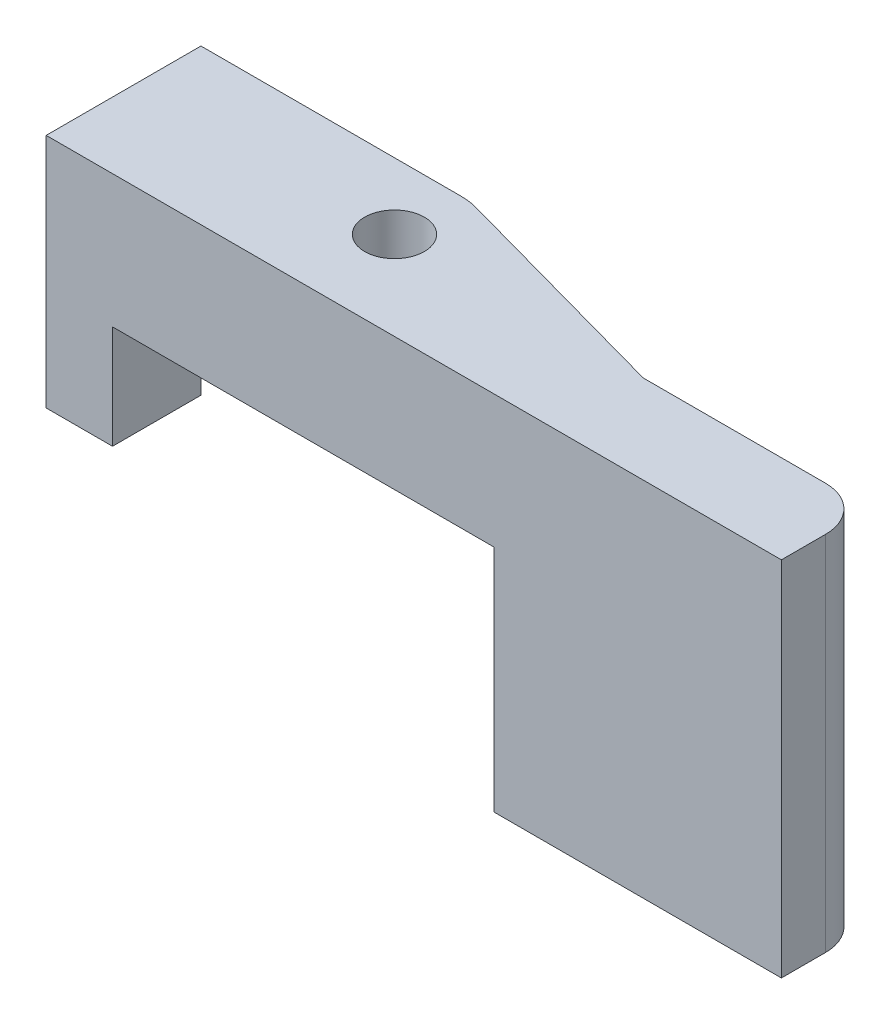
ISO-10303-21;
HEADER;
FILE_DESCRIPTION(('STEP AP214'),'2;1');
FILE_NAME('part.step','',(''),(''),'','','');
FILE_SCHEMA(('AUTOMOTIVE_DESIGN { 1 0 10303 214 1 1 1 1 }'));
ENDSEC;
DATA;
#1=APPLICATION_CONTEXT('core data for automotive mechanical design processes');
#2=APPLICATION_PROTOCOL_DEFINITION('international standard','automotive_design',2000,#1);
#3=PRODUCT_CONTEXT('',#1,'mechanical');
#4=PRODUCT('Part','Part','',(#3));
#5=PRODUCT_RELATED_PRODUCT_CATEGORY('part','',(#4));
#6=PRODUCT_DEFINITION_FORMATION('','',#4);
#7=PRODUCT_DEFINITION_CONTEXT('part definition',#1,'design');
#8=PRODUCT_DEFINITION('design','',#6,#7);
#9=PRODUCT_DEFINITION_SHAPE('','',#8);
#10=(LENGTH_UNIT() NAMED_UNIT(*) SI_UNIT(.MILLI.,.METRE.));
#11=(NAMED_UNIT(*) PLANE_ANGLE_UNIT() SI_UNIT($,.RADIAN.));
#12=(NAMED_UNIT(*) SI_UNIT($,.STERADIAN.) SOLID_ANGLE_UNIT());
#13=UNCERTAINTY_MEASURE_WITH_UNIT(LENGTH_MEASURE(1.E-05),#10,'distance_accuracy_value','');
#14=(GEOMETRIC_REPRESENTATION_CONTEXT(3) GLOBAL_UNCERTAINTY_ASSIGNED_CONTEXT((#13)) GLOBAL_UNIT_ASSIGNED_CONTEXT((#10,
#11,#12)) REPRESENTATION_CONTEXT('',''));
#15=CARTESIAN_POINT('',(0.,0.,0.));
#16=DIRECTION('',(0.,0.,1.));
#17=DIRECTION('',(1.,0.,0.));
#18=AXIS2_PLACEMENT_3D('',#15,#16,#17);
#19=CARTESIAN_POINT('',(0.,0.,0.));
#20=DIRECTION('',(0.,-1.,0.));
#21=DIRECTION('',(0.,0.,1.));
#22=AXIS2_PLACEMENT_3D('',#19,#20,#21);
#23=PLANE('',#22);
#24=DIRECTION('',(-1.,0.,0.));
#25=VECTOR('',#24,1.);
#26=CARTESIAN_POINT('',(0.,0.,0.));
#27=LINE('',#26,#25);
#28=CARTESIAN_POINT('',(-8.75411972844536,0.,0.));
#29=VERTEX_POINT('',#28);
#30=CARTESIAN_POINT('',(-11.7541197284454,0.,0.));
#31=VERTEX_POINT('',#30);
#32=EDGE_CURVE('E132',#29,#31,#27,.T.);
#33=ORIENTED_EDGE('',*,*,#32,.T.);
#34=DIRECTION('',(0.,0.,-1.));
#35=VECTOR('',#34,1.);
#36=CARTESIAN_POINT('',(-11.7541197284454,0.,-3.00000000000001));
#37=LINE('',#36,#35);
#38=CARTESIAN_POINT('',(-11.7541197284454,0.,-3.00000000000001));
#39=VERTEX_POINT('',#38);
#40=EDGE_CURVE('E137',#31,#39,#37,.T.);
#41=ORIENTED_EDGE('',*,*,#40,.T.);
#42=DIRECTION('',(1.,0.,0.));
#43=VECTOR('',#42,1.);
#44=CARTESIAN_POINT('',(0.,0.,-3.00000000000001));
#45=LINE('',#44,#43);
#46=CARTESIAN_POINT('',(0.,0.,-3.00000000000001));
#47=VERTEX_POINT('',#46);
#48=EDGE_CURVE('E154',#39,#47,#45,.T.);
#49=ORIENTED_EDGE('',*,*,#48,.T.);
#50=CARTESIAN_POINT('',(0.,0.,0.));
#51=DIRECTION('',(0.,1.,0.));
#52=DIRECTION('',(0.,0.,1.));
#53=AXIS2_PLACEMENT_3D('',#50,#51,#52);
#54=CIRCLE('',#53,3.00000000000001);
#55=CARTESIAN_POINT('',(0.800000000000003,0.,-2.8913664589602));
#56=VERTEX_POINT('',#55);
#57=EDGE_CURVE('E270',#56,#47,#54,.T.);
#58=ORIENTED_EDGE('',*,*,#57,.F.);
#59=DIRECTION('',(0.963788819653397,0.,0.266666666666667));
#60=VECTOR('',#59,1.);
#61=CARTESIAN_POINT('',(0.800000000000003,0.,-2.8913664589602));
#62=LINE('',#61,#60);
#63=CARTESIAN_POINT('',(11.2500000000007,0.,0.));
#64=VERTEX_POINT('',#63);
#65=EDGE_CURVE('E179',#56,#64,#62,.T.);
#66=ORIENTED_EDGE('',*,*,#65,.T.);
#67=DIRECTION('',(-1.,0.,0.));
#68=VECTOR('',#67,1.);
#69=CARTESIAN_POINT('',(0.,0.,0.));
#70=LINE('',#69,#68);
#71=CARTESIAN_POINT('',(8.50000000000002,0.,0.));
#72=VERTEX_POINT('',#71);
#73=EDGE_CURVE('E187',#64,#72,#70,.T.);
#74=ORIENTED_EDGE('',*,*,#73,.T.);
#75=DIRECTION('',(0.,0.,1.));
#76=VECTOR('',#75,1.);
#77=CARTESIAN_POINT('',(8.50000000000003,0.,0.));
#78=LINE('',#77,#76);
#79=CARTESIAN_POINT('',(8.50000000000002,0.,3.99999999999996));
#80=VERTEX_POINT('',#79);
#81=EDGE_CURVE('E198',#72,#80,#78,.T.);
#82=ORIENTED_EDGE('',*,*,#81,.T.);
#83=DIRECTION('',(-1.,0.,0.));
#84=VECTOR('',#83,1.);
#85=CARTESIAN_POINT('',(0.,0.,3.99999999999996));
#86=LINE('',#85,#84);
#87=CARTESIAN_POINT('',(-8.75411972844536,0.,3.99999999999996));
#88=VERTEX_POINT('',#87);
#89=EDGE_CURVE('E250',#80,#88,#86,.T.);
#90=ORIENTED_EDGE('',*,*,#89,.T.);
#91=DIRECTION('',(0.,0.,-1.));
#92=VECTOR('',#91,1.);
#93=CARTESIAN_POINT('',(-8.75411972844536,0.,3.99999999999996));
#94=LINE('',#93,#92);
#95=EDGE_CURVE('E150',#88,#29,#94,.T.);
#96=ORIENTED_EDGE('',*,*,#95,.T.);
#97=EDGE_LOOP('',(#33,#41,#49,#58,#66,#74,#82,#90,#96));
#98=FACE_BOUND('',#97,.T.);
#99=CARTESIAN_POINT('',(0.,0.,0.));
#100=DIRECTION('',(0.,1.,0.));
#101=DIRECTION('',(0.,0.,1.));
#102=AXIS2_PLACEMENT_3D('',#99,#100,#101);
#103=CIRCLE('',#102,1.35);
#104=CARTESIAN_POINT('',(0.,0.,1.35));
#105=VERTEX_POINT('',#104);
#106=EDGE_CURVE('E176',#105,#105,#103,.T.);
#107=ORIENTED_EDGE('',*,*,#106,.T.);
#108=EDGE_LOOP('',(#107));
#109=FACE_BOUND('',#108,.T.);
#110=ADVANCED_FACE('F34',(#98,#109),#23,.T.);
#111=CARTESIAN_POINT('',(21.5,6.,0.));
#112=DIRECTION('',(-1.,0.,0.));
#113=DIRECTION('',(0.,0.,-1.));
#114=AXIS2_PLACEMENT_3D('',#111,#112,#113);
#115=PLANE('',#114);
#116=DIRECTION('',(0.,0.,1.));
#117=VECTOR('',#116,1.);
#118=CARTESIAN_POINT('',(21.5,6.,0.));
#119=LINE('',#118,#117);
#120=CARTESIAN_POINT('',(21.5,6.,1.99999999999996));
#121=VERTEX_POINT('',#120);
#122=CARTESIAN_POINT('',(21.5,6.,3.99999999999996));
#123=VERTEX_POINT('',#122);
#124=EDGE_CURVE('E246',#121,#123,#119,.T.);
#125=ORIENTED_EDGE('',*,*,#124,.T.);
#126=DIRECTION('',(0.,-1.,0.));
#127=VECTOR('',#126,1.);
#128=CARTESIAN_POINT('',(21.5,6.,3.99999999999996));
#129=LINE('',#128,#127);
#130=CARTESIAN_POINT('',(21.5,-10.38,3.99999999999996));
#131=VERTEX_POINT('',#130);
#132=EDGE_CURVE('E212',#123,#131,#129,.T.);
#133=ORIENTED_EDGE('',*,*,#132,.T.);
#134=DIRECTION('',(0.,0.,-1.));
#135=VECTOR('',#134,1.);
#136=CARTESIAN_POINT('',(21.5,-10.38,0.));
#137=LINE('',#136,#135);
#138=CARTESIAN_POINT('',(21.5,-10.38,1.99999999999996));
#139=VERTEX_POINT('',#138);
#140=EDGE_CURVE('E262',#131,#139,#137,.T.);
#141=ORIENTED_EDGE('',*,*,#140,.T.);
#142=DIRECTION('',(0.,-1.,0.));
#143=VECTOR('',#142,1.);
#144=CARTESIAN_POINT('',(21.5,6.,1.99999999999996));
#145=LINE('',#144,#143);
#146=EDGE_CURVE('E208',#121,#139,#145,.T.);
#147=ORIENTED_EDGE('',*,*,#146,.F.);
#148=EDGE_LOOP('',(#125,#133,#141,#147));
#149=FACE_BOUND('',#148,.T.);
#150=ADVANCED_FACE('F291',(#149),#115,.F.);
#151=CARTESIAN_POINT('',(0.,6.,3.99999999999996));
#152=DIRECTION('',(0.,0.,-1.));
#153=DIRECTION('',(1.,0.,0.));
#154=AXIS2_PLACEMENT_3D('',#151,#152,#153);
#155=PLANE('',#154);
#156=ORIENTED_EDGE('',*,*,#89,.F.);
#157=DIRECTION('',(0.,1.,0.));
#158=VECTOR('',#157,1.);
#159=CARTESIAN_POINT('',(8.50000000000002,-23.9814705087355,3.99999999999996));
#160=LINE('',#159,#158);
#161=CARTESIAN_POINT('',(8.50000000000002,-10.38,3.99999999999996));
#162=VERTEX_POINT('',#161);
#163=EDGE_CURVE('E202',#162,#80,#160,.T.);
#164=ORIENTED_EDGE('',*,*,#163,.F.);
#165=DIRECTION('',(1.,0.,0.));
#166=VECTOR('',#165,1.);
#167=CARTESIAN_POINT('',(21.5,-10.38,3.99999999999996));
#168=LINE('',#167,#166);
#169=EDGE_CURVE('E258',#162,#131,#168,.T.);
#170=ORIENTED_EDGE('',*,*,#169,.T.);
#171=ORIENTED_EDGE('',*,*,#132,.F.);
#172=DIRECTION('',(-1.,0.,0.));
#173=VECTOR('',#172,1.);
#174=CARTESIAN_POINT('',(0.,6.,3.99999999999996));
#175=LINE('',#174,#173);
#176=CARTESIAN_POINT('',(-11.7541197284454,6.,3.99999999999996));
#177=VERTEX_POINT('',#176);
#178=EDGE_CURVE('E235',#123,#177,#175,.T.);
#179=ORIENTED_EDGE('',*,*,#178,.T.);
#180=DIRECTION('',(0.,1.,0.));
#181=VECTOR('',#180,1.);
#182=CARTESIAN_POINT('',(-11.7541197284454,-4.,3.99999999999996));
#183=LINE('',#182,#181);
#184=CARTESIAN_POINT('',(-11.7541197284454,-4.68,3.99999999999996));
#185=VERTEX_POINT('',#184);
#186=EDGE_CURVE('E171',#185,#177,#183,.T.);
#187=ORIENTED_EDGE('',*,*,#186,.F.);
#188=DIRECTION('',(-1.,0.,0.));
#189=VECTOR('',#188,1.);
#190=CARTESIAN_POINT('',(-11.7541197284454,-4.68,3.99999999999996));
#191=LINE('',#190,#189);
#192=CARTESIAN_POINT('',(-8.75411972844536,-4.68,3.99999999999996));
#193=VERTEX_POINT('',#192);
#194=EDGE_CURVE('E160',#193,#185,#191,.T.);
#195=ORIENTED_EDGE('',*,*,#194,.F.);
#196=DIRECTION('',(0.,1.,0.));
#197=VECTOR('',#196,1.);
#198=CARTESIAN_POINT('',(-8.75411972844536,-9.67999999999996,3.99999999999996));
#199=LINE('',#198,#197);
#200=EDGE_CURVE('E167',#193,#88,#199,.T.);
#201=ORIENTED_EDGE('',*,*,#200,.T.);
#202=EDGE_LOOP('',(#156,#164,#170,#171,#179,#187,#195,#201));
#203=FACE_BOUND('',#202,.T.);
#204=ADVANCED_FACE('F242',(#203),#155,.F.);
#205=CARTESIAN_POINT('',(0.,6.,0.));
#206=DIRECTION('',(0.,0.,1.));
#207=DIRECTION('',(-1.,0.,0.));
#208=AXIS2_PLACEMENT_3D('',#205,#206,#207);
#209=PLANE('',#208);
#210=DIRECTION('',(0.,1.,0.));
#211=VECTOR('',#210,1.);
#212=CARTESIAN_POINT('',(11.25,-10.9877381215216,0.));
#213=LINE('',#212,#211);
#214=CARTESIAN_POINT('',(11.2500000000007,6.,0.));
#215=VERTEX_POINT('',#214);
#216=EDGE_CURVE('E182',#64,#215,#213,.T.);
#217=ORIENTED_EDGE('',*,*,#216,.T.);
#218=DIRECTION('',(1.,0.,0.));
#219=VECTOR('',#218,1.);
#220=CARTESIAN_POINT('',(0.,6.,0.));
#221=LINE('',#220,#219);
#222=CARTESIAN_POINT('',(19.5,6.,0.));
#223=VERTEX_POINT('',#222);
#224=EDGE_CURVE('E245',#215,#223,#221,.T.);
#225=ORIENTED_EDGE('',*,*,#224,.T.);
#226=DIRECTION('',(0.,-1.,0.));
#227=VECTOR('',#226,1.);
#228=CARTESIAN_POINT('',(19.5,6.,0.));
#229=LINE('',#228,#227);
#230=CARTESIAN_POINT('',(19.5,-10.38,0.));
#231=VERTEX_POINT('',#230);
#232=EDGE_CURVE('E214',#231,#223,#229,.F.);
#233=ORIENTED_EDGE('',*,*,#232,.F.);
#234=DIRECTION('',(-1.,0.,0.));
#235=VECTOR('',#234,1.);
#236=CARTESIAN_POINT('',(21.5,-10.38,0.));
#237=LINE('',#236,#235);
#238=CARTESIAN_POINT('',(8.50000000000003,-10.38,0.));
#239=VERTEX_POINT('',#238);
#240=EDGE_CURVE('E267',#231,#239,#237,.T.);
#241=ORIENTED_EDGE('',*,*,#240,.T.);
#242=DIRECTION('',(0.,1.,0.));
#243=VECTOR('',#242,1.);
#244=CARTESIAN_POINT('',(8.50000000000003,-23.9814705087355,0.));
#245=LINE('',#244,#243);
#246=EDGE_CURVE('E192',#239,#72,#245,.T.);
#247=ORIENTED_EDGE('',*,*,#246,.T.);
#248=ORIENTED_EDGE('',*,*,#73,.F.);
#249=EDGE_LOOP('',(#217,#225,#233,#241,#247,#248));
#250=FACE_BOUND('',#249,.T.);
#251=ADVANCED_FACE('F230',(#250),#209,.F.);
#252=CARTESIAN_POINT('',(0.,6.,0.));
#253=DIRECTION('',(0.,-1.,0.));
#254=DIRECTION('',(0.,0.,1.));
#255=AXIS2_PLACEMENT_3D('',#252,#253,#254);
#256=PLANE('',#255);
#257=CARTESIAN_POINT('',(0.,6.,0.));
#258=DIRECTION('',(0.,-1.,0.));
#259=DIRECTION('',(0.,0.,-1.));
#260=AXIS2_PLACEMENT_3D('',#257,#258,#259);
#261=CIRCLE('',#260,1.35);
#262=CARTESIAN_POINT('',(0.,6.,-1.35));
#263=VERTEX_POINT('',#262);
#264=EDGE_CURVE('E173',#263,#263,#261,.T.);
#265=ORIENTED_EDGE('',*,*,#264,.T.);
#266=EDGE_LOOP('',(#265));
#267=FACE_BOUND('',#266,.T.);
#268=DIRECTION('',(0.,0.,1.));
#269=VECTOR('',#268,1.);
#270=CARTESIAN_POINT('',(-11.7541197284454,6.,0.));
#271=LINE('',#270,#269);
#272=CARTESIAN_POINT('',(-11.7541197284454,6.,-3.00000000000001));
#273=VERTEX_POINT('',#272);
#274=EDGE_CURVE('E164',#273,#177,#271,.T.);
#275=ORIENTED_EDGE('',*,*,#274,.T.);
#276=ORIENTED_EDGE('',*,*,#178,.F.);
#277=ORIENTED_EDGE('',*,*,#124,.F.);
#278=CARTESIAN_POINT('',(19.5,6.,1.99999999999996));
#279=DIRECTION('',(0.,1.,0.));
#280=DIRECTION('',(0.,0.,1.));
#281=AXIS2_PLACEMENT_3D('',#278,#279,#280);
#282=CIRCLE('',#281,2.);
#283=EDGE_CURVE('E42',#223,#121,#282,.F.);
#284=ORIENTED_EDGE('',*,*,#283,.F.);
#285=ORIENTED_EDGE('',*,*,#224,.F.);
#286=DIRECTION('',(0.963788819653397,0.,0.266666666666667));
#287=VECTOR('',#286,1.);
#288=CARTESIAN_POINT('',(0.800000000000003,6.,-2.8913664589602));
#289=LINE('',#288,#287);
#290=CARTESIAN_POINT('',(0.800000000000003,6.,-2.8913664589602));
#291=VERTEX_POINT('',#290);
#292=EDGE_CURVE('E177',#291,#215,#289,.T.);
#293=ORIENTED_EDGE('',*,*,#292,.F.);
#294=CARTESIAN_POINT('',(0.,6.,0.));
#295=DIRECTION('',(0.,1.,0.));
#296=DIRECTION('',(0.,0.,1.));
#297=AXIS2_PLACEMENT_3D('',#294,#295,#296);
#298=CIRCLE('',#297,3.00000000000001);
#299=CARTESIAN_POINT('',(0.,6.,-3.00000000000001));
#300=VERTEX_POINT('',#299);
#301=EDGE_CURVE('E257',#300,#291,#298,.F.);
#302=ORIENTED_EDGE('',*,*,#301,.F.);
#303=DIRECTION('',(1.,0.,0.));
#304=VECTOR('',#303,1.);
#305=CARTESIAN_POINT('',(0.,6.,-3.00000000000001));
#306=LINE('',#305,#304);
#307=EDGE_CURVE('E144',#273,#300,#306,.T.);
#308=ORIENTED_EDGE('',*,*,#307,.F.);
#309=EDGE_LOOP('',(#275,#276,#277,#284,#285,#293,#302,#308));
#310=FACE_BOUND('',#309,.T.);
#311=ADVANCED_FACE('F227',(#267,#310),#256,.F.);
#312=CARTESIAN_POINT('',(0.,26.1949077574565,0.));
#313=DIRECTION('',(0.,0.,1.));
#314=DIRECTION('',(-1.,0.,0.));
#315=AXIS2_PLACEMENT_3D('',#312,#313,#314);
#316=PLANE('',#315);
#317=DIRECTION('',(0.,1.,0.));
#318=VECTOR('',#317,1.);
#319=CARTESIAN_POINT('',(-8.75411972844536,-9.67999999999996,0.));
#320=LINE('',#319,#318);
#321=CARTESIAN_POINT('',(-8.75411972844536,-4.68,0.));
#322=VERTEX_POINT('',#321);
#323=EDGE_CURVE('E152',#322,#29,#320,.T.);
#324=ORIENTED_EDGE('',*,*,#323,.F.);
#325=DIRECTION('',(1.,0.,0.));
#326=VECTOR('',#325,1.);
#327=CARTESIAN_POINT('',(-11.7541197284454,-4.68,0.));
#328=LINE('',#327,#326);
#329=CARTESIAN_POINT('',(-11.7541197284454,-4.68,0.));
#330=VERTEX_POINT('',#329);
#331=EDGE_CURVE('E134',#330,#322,#328,.T.);
#332=ORIENTED_EDGE('',*,*,#331,.F.);
#333=DIRECTION('',(0.,-1.,0.));
#334=VECTOR('',#333,1.);
#335=CARTESIAN_POINT('',(-11.7541197284454,26.1949077574565,0.));
#336=LINE('',#335,#334);
#337=EDGE_CURVE('E11',#31,#330,#336,.T.);
#338=ORIENTED_EDGE('',*,*,#337,.F.);
#339=ORIENTED_EDGE('',*,*,#32,.F.);
#340=EDGE_LOOP('',(#324,#332,#338,#339));
#341=FACE_BOUND('',#340,.T.);
#342=ADVANCED_FACE('F130',(#341),#316,.F.);
#343=CARTESIAN_POINT('',(0.,26.1949077574565,0.));
#344=DIRECTION('',(0.,-1.,0.));
#345=DIRECTION('',(0.,0.,1.));
#346=AXIS2_PLACEMENT_3D('',#343,#344,#345);
#347=CYLINDRICAL_SURFACE('',#346,3.00000000000001);
#348=DIRECTION('',(0.,1.,0.));
#349=VECTOR('',#348,1.);
#350=CARTESIAN_POINT('',(0.,-12.4415630442971,-3.00000000000001));
#351=LINE('',#350,#349);
#352=EDGE_CURVE('E49',#47,#300,#351,.T.);
#353=ORIENTED_EDGE('',*,*,#352,.T.);
#354=ORIENTED_EDGE('',*,*,#301,.T.);
#355=DIRECTION('',(0.,1.,0.));
#356=VECTOR('',#355,1.);
#357=CARTESIAN_POINT('',(0.800000000000003,-10.9877381215216,-2.8913664589602));
#358=LINE('',#357,#356);
#359=EDGE_CURVE('E185',#56,#291,#358,.T.);
#360=ORIENTED_EDGE('',*,*,#359,.F.);
#361=ORIENTED_EDGE('',*,*,#57,.T.);
#362=EDGE_LOOP('',(#353,#354,#360,#361));
#363=FACE_BOUND('',#362,.T.);
#364=ADVANCED_FACE('F272',(#363),#347,.T.);
#365=CARTESIAN_POINT('',(8.50000000000003,-23.9814705087355,0.));
#366=DIRECTION('',(1.,0.,0.));
#367=DIRECTION('',(0.,0.,1.));
#368=AXIS2_PLACEMENT_3D('',#365,#366,#367);
#369=PLANE('',#368);
#370=DIRECTION('',(0.,0.,1.));
#371=VECTOR('',#370,1.);
#372=CARTESIAN_POINT('',(8.50000000000003,-10.38,0.));
#373=LINE('',#372,#371);
#374=EDGE_CURVE('E195',#239,#162,#373,.T.);
#375=ORIENTED_EDGE('',*,*,#374,.T.);
#376=ORIENTED_EDGE('',*,*,#163,.T.);
#377=ORIENTED_EDGE('',*,*,#81,.F.);
#378=ORIENTED_EDGE('',*,*,#246,.F.);
#379=EDGE_LOOP('',(#375,#376,#377,#378));
#380=FACE_BOUND('',#379,.T.);
#381=ADVANCED_FACE('F327',(#380),#369,.F.);
#382=CARTESIAN_POINT('',(0.,-10.38,0.));
#383=DIRECTION('',(0.,-1.,0.));
#384=DIRECTION('',(-0.707106781186548,0.,-0.707106781186547));
#385=AXIS2_PLACEMENT_3D('',#382,#383,#384);
#386=PLANE('',#385);
#387=ORIENTED_EDGE('',*,*,#140,.F.);
#388=ORIENTED_EDGE('',*,*,#169,.F.);
#389=ORIENTED_EDGE('',*,*,#374,.F.);
#390=ORIENTED_EDGE('',*,*,#240,.F.);
#391=CARTESIAN_POINT('',(19.5,-10.38,1.99999999999996));
#392=DIRECTION('',(0.,1.,0.));
#393=DIRECTION('',(0.,0.,1.));
#394=AXIS2_PLACEMENT_3D('',#391,#392,#393);
#395=CIRCLE('',#394,2.);
#396=EDGE_CURVE('E211',#139,#231,#395,.T.);
#397=ORIENTED_EDGE('',*,*,#396,.F.);
#398=EDGE_LOOP('',(#387,#388,#389,#390,#397));
#399=FACE_BOUND('',#398,.T.);
#400=ADVANCED_FACE('F333',(#399),#386,.T.);
#401=CARTESIAN_POINT('',(19.5,6.,1.99999999999996));
#402=DIRECTION('',(0.,-1.,0.));
#403=DIRECTION('',(0.,0.,1.));
#404=AXIS2_PLACEMENT_3D('',#401,#402,#403);
#405=CYLINDRICAL_SURFACE('',#404,2.);
#406=ORIENTED_EDGE('',*,*,#283,.T.);
#407=ORIENTED_EDGE('',*,*,#146,.T.);
#408=ORIENTED_EDGE('',*,*,#396,.T.);
#409=ORIENTED_EDGE('',*,*,#232,.T.);
#410=EDGE_LOOP('',(#406,#407,#408,#409));
#411=FACE_BOUND('',#410,.T.);
#412=ADVANCED_FACE('F36',(#411),#405,.T.);
#413=CARTESIAN_POINT('',(0.800000000000003,-10.9877381215216,-2.8913664589602));
#414=DIRECTION('',(0.266666666666667,0.,-0.963788819653397));
#415=DIRECTION('',(0.963788819653397,0.,0.266666666666667));
#416=AXIS2_PLACEMENT_3D('',#413,#414,#415);
#417=PLANE('',#416);
#418=ORIENTED_EDGE('',*,*,#359,.T.);
#419=ORIENTED_EDGE('',*,*,#292,.T.);
#420=ORIENTED_EDGE('',*,*,#216,.F.);
#421=ORIENTED_EDGE('',*,*,#65,.F.);
#422=EDGE_LOOP('',(#418,#419,#420,#421));
#423=FACE_BOUND('',#422,.T.);
#424=ADVANCED_FACE('F223',(#423),#417,.T.);
#425=CARTESIAN_POINT('',(0.,-4.,0.));
#426=DIRECTION('',(0.,1.,0.));
#427=DIRECTION('',(0.,0.,-1.));
#428=AXIS2_PLACEMENT_3D('',#425,#426,#427);
#429=CYLINDRICAL_SURFACE('',#428,1.35);
#430=ORIENTED_EDGE('',*,*,#106,.F.);
#431=EDGE_LOOP('',(#430));
#432=FACE_BOUND('',#431,.T.);
#433=ORIENTED_EDGE('',*,*,#264,.F.);
#434=EDGE_LOOP('',(#433));
#435=FACE_BOUND('',#434,.T.);
#436=ADVANCED_FACE('F220',(#432,#435),#429,.F.);
#437=CARTESIAN_POINT('',(-11.7541197284454,-4.,0.));
#438=DIRECTION('',(1.,0.,0.));
#439=DIRECTION('',(0.,0.,1.));
#440=AXIS2_PLACEMENT_3D('',#437,#438,#439);
#441=PLANE('',#440);
#442=ORIENTED_EDGE('',*,*,#186,.T.);
#443=ORIENTED_EDGE('',*,*,#274,.F.);
#444=DIRECTION('',(0.,1.,0.));
#445=VECTOR('',#444,1.);
#446=CARTESIAN_POINT('',(-11.7541197284454,-12.4415630442971,-3.00000000000001));
#447=LINE('',#446,#445);
#448=EDGE_CURVE('E141',#39,#273,#447,.T.);
#449=ORIENTED_EDGE('',*,*,#448,.F.);
#450=ORIENTED_EDGE('',*,*,#40,.F.);
#451=ORIENTED_EDGE('',*,*,#337,.T.);
#452=DIRECTION('',(0.,0.,-1.));
#453=VECTOR('',#452,1.);
#454=CARTESIAN_POINT('',(-11.7541197284454,-4.68,3.99999999999996));
#455=LINE('',#454,#453);
#456=EDGE_CURVE('E163',#185,#330,#455,.T.);
#457=ORIENTED_EDGE('',*,*,#456,.F.);
#458=EDGE_LOOP('',(#442,#443,#449,#450,#451,#457));
#459=FACE_BOUND('',#458,.T.);
#460=ADVANCED_FACE('F139',(#459),#441,.F.);
#461=CARTESIAN_POINT('',(-8.75411972844536,-9.67999999999996,3.99999999999996));
#462=DIRECTION('',(-1.,0.,0.));
#463=DIRECTION('',(0.,0.,-1.));
#464=AXIS2_PLACEMENT_3D('',#461,#462,#463);
#465=PLANE('',#464);
#466=ORIENTED_EDGE('',*,*,#323,.T.);
#467=ORIENTED_EDGE('',*,*,#95,.F.);
#468=ORIENTED_EDGE('',*,*,#200,.F.);
#469=DIRECTION('',(0.,0.,1.));
#470=VECTOR('',#469,1.);
#471=CARTESIAN_POINT('',(-8.75411972844536,-4.68,3.99999999999996));
#472=LINE('',#471,#470);
#473=EDGE_CURVE('E158',#322,#193,#472,.T.);
#474=ORIENTED_EDGE('',*,*,#473,.F.);
#475=EDGE_LOOP('',(#466,#467,#468,#474));
#476=FACE_BOUND('',#475,.T.);
#477=ADVANCED_FACE('F287',(#476),#465,.F.);
#478=CARTESIAN_POINT('',(-61.7871283174364,-4.68,-74.1959594928933));
#479=DIRECTION('',(0.,1.,0.));
#480=DIRECTION('',(0.707106781186548,0.,0.707106781186547));
#481=AXIS2_PLACEMENT_3D('',#478,#479,#480);
#482=PLANE('',#481);
#483=ORIENTED_EDGE('',*,*,#194,.T.);
#484=ORIENTED_EDGE('',*,*,#456,.T.);
#485=ORIENTED_EDGE('',*,*,#331,.T.);
#486=ORIENTED_EDGE('',*,*,#473,.T.);
#487=EDGE_LOOP('',(#483,#484,#485,#486));
#488=FACE_BOUND('',#487,.T.);
#489=ADVANCED_FACE('F282',(#488),#482,.F.);
#490=CARTESIAN_POINT('',(0.,-12.4415630442971,-3.00000000000001));
#491=DIRECTION('',(0.,0.,-1.));
#492=DIRECTION('',(1.,0.,0.));
#493=AXIS2_PLACEMENT_3D('',#490,#491,#492);
#494=PLANE('',#493);
#495=ORIENTED_EDGE('',*,*,#448,.T.);
#496=ORIENTED_EDGE('',*,*,#307,.T.);
#497=ORIENTED_EDGE('',*,*,#352,.F.);
#498=ORIENTED_EDGE('',*,*,#48,.F.);
#499=EDGE_LOOP('',(#495,#496,#497,#498));
#500=FACE_BOUND('',#499,.T.);
#501=ADVANCED_FACE('F280',(#500),#494,.T.);
#502=CLOSED_SHELL('',(#110,#150,#204,#251,#311,#342,#364,#381,#400,#412,#424,#436,#460,#477,
#489,#501));
#503=MANIFOLD_SOLID_BREP('B2',#502);
#504=ADVANCED_BREP_SHAPE_REPRESENTATION('',(#18,#503),#14);
#505=SHAPE_DEFINITION_REPRESENTATION(#9,#504);
ENDSEC;
END-ISO-10303-21;
